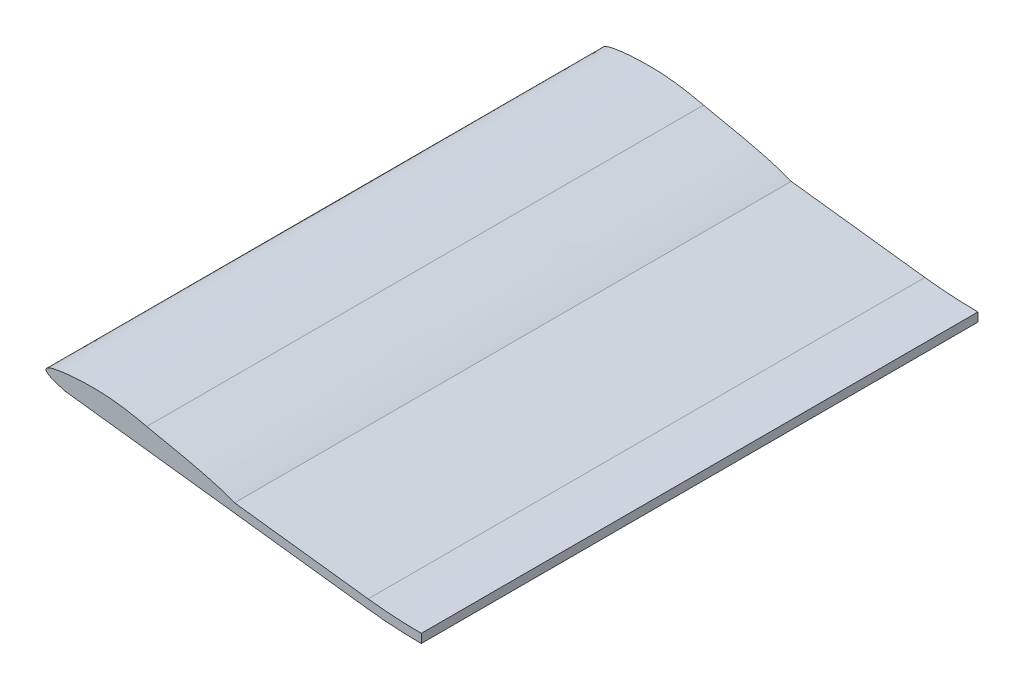
ISO-10303-21;
HEADER;
FILE_DESCRIPTION(('STEP AP214'),'2;1');
FILE_NAME('part.step','',(''),(''),'','','');
FILE_SCHEMA(('AUTOMOTIVE_DESIGN { 1 0 10303 214 1 1 1 1 }'));
ENDSEC;
DATA;
#1=APPLICATION_CONTEXT('core data for automotive mechanical design processes');
#2=APPLICATION_PROTOCOL_DEFINITION('international standard','automotive_design',2000,#1);
#3=PRODUCT_CONTEXT('',#1,'mechanical');
#4=PRODUCT('Part','Part','',(#3));
#5=PRODUCT_RELATED_PRODUCT_CATEGORY('part','',(#4));
#6=PRODUCT_DEFINITION_FORMATION('','',#4);
#7=PRODUCT_DEFINITION_CONTEXT('part definition',#1,'design');
#8=PRODUCT_DEFINITION('design','',#6,#7);
#9=PRODUCT_DEFINITION_SHAPE('','',#8);
#10=(LENGTH_UNIT() NAMED_UNIT(*) SI_UNIT(.MILLI.,.METRE.));
#11=(NAMED_UNIT(*) PLANE_ANGLE_UNIT() SI_UNIT($,.RADIAN.));
#12=(NAMED_UNIT(*) SI_UNIT($,.STERADIAN.) SOLID_ANGLE_UNIT());
#13=UNCERTAINTY_MEASURE_WITH_UNIT(LENGTH_MEASURE(1.E-05),#10,'distance_accuracy_value','');
#14=(GEOMETRIC_REPRESENTATION_CONTEXT(3) GLOBAL_UNCERTAINTY_ASSIGNED_CONTEXT((#13)) GLOBAL_UNIT_ASSIGNED_CONTEXT((#10,
#11,#12)) REPRESENTATION_CONTEXT('',''));
#15=CARTESIAN_POINT('',(0.,0.,0.));
#16=DIRECTION('',(0.,0.,1.));
#17=DIRECTION('',(1.,0.,0.));
#18=AXIS2_PLACEMENT_3D('',#15,#16,#17);
#19=CARTESIAN_POINT('',(-1376.89946624241,7.97944159795149,300.));
#20=CARTESIAN_POINT('',(-1400.62692267339,14.4748176161241,300.));
#21=CARTESIAN_POINT('',(-1356.47241270451,20.4165278977863,300.));
#22=CARTESIAN_POINT('',(-1325.57377215526,12.1218735207099,300.));
#23=CARTESIAN_POINT('',(-1294.16714389737,6.70322635564015,300.));
#24=CARTESIAN_POINT('',(-1280.44105962162,1.1733876229176,300.));
#25=B_SPLINE_CURVE_WITH_KNOTS('',3,(#19,#20,#21,#22,#23,#24),.UNSPECIFIED.,.F.,.F.,(4,1,1,4),
(0.,0.297228768096899,0.6124069189747,1.),.UNSPECIFIED.);
#26=DIRECTION('',(0.,0.,-1.));
#27=VECTOR('',#26,1.);
#28=SURFACE_OF_LINEAR_EXTRUSION('',#25,#27);
#29=DIRECTION('',(0.,0.,-1.));
#30=VECTOR('',#29,1.);
#31=CARTESIAN_POINT('',(-1387.26742948358,13.7744205498702,300.));
#32=LINE('',#31,#30);
#33=CARTESIAN_POINT('',(-1387.26742948358,13.7744205498701,616.));
#34=VERTEX_POINT('',#33);
#35=CARTESIAN_POINT('',(-1387.26742948358,13.7744205498702,300.));
#36=VERTEX_POINT('',#35);
#37=EDGE_CURVE('E13',#34,#36,#32,.T.);
#38=ORIENTED_EDGE('',*,*,#37,.T.);
#39=CARTESIAN_POINT('',(-1376.89946624241,7.97944159795149,300.));
#40=CARTESIAN_POINT('',(-1400.62692267339,14.4748176161241,300.));
#41=CARTESIAN_POINT('',(-1356.47241270451,20.4165278977863,300.));
#42=CARTESIAN_POINT('',(-1325.57377215526,12.1218735207099,300.));
#43=CARTESIAN_POINT('',(-1294.16714389737,6.70322635564015,300.));
#44=CARTESIAN_POINT('',(-1280.44105962162,1.1733876229176,300.));
#45=B_SPLINE_CURVE_WITH_KNOTS('',3,(#39,#40,#41,#42,#43,#44),.UNSPECIFIED.,.F.,.F.,(4,1,1,4),
(0.,0.297228768096899,0.6124069189747,1.),.UNSPECIFIED.);
#46=CARTESIAN_POINT('',(-1376.89946624241,7.97944159795149,300.));
#47=VERTEX_POINT('',#46);
#48=EDGE_CURVE('E189',#47,#36,#45,.T.);
#49=ORIENTED_EDGE('',*,*,#48,.F.);
#50=DIRECTION('',(0.,0.,-1.));
#51=VECTOR('',#50,1.);
#52=CARTESIAN_POINT('',(-1376.89946624241,7.97944159795149,300.));
#53=LINE('',#52,#51);
#54=CARTESIAN_POINT('',(-1376.89946624241,7.97944159795149,616.));
#55=VERTEX_POINT('',#54);
#56=EDGE_CURVE('E180',#55,#47,#53,.T.);
#57=ORIENTED_EDGE('',*,*,#56,.F.);
#58=CARTESIAN_POINT('',(-1376.89946624241,7.97944159795149,616.));
#59=CARTESIAN_POINT('',(-1377.10559932181,8.03587358965808,616.));
#60=CARTESIAN_POINT('',(-1377.31156661358,8.09291446148049,616.));
#61=CARTESIAN_POINT('',(-1377.72572935339,8.20906121368225,616.));
#62=CARTESIAN_POINT('',(-1377.93392003424,8.26818408733904,616.));
#63=CARTESIAN_POINT('',(-1378.35202039858,8.38853903831141,616.));
#64=CARTESIAN_POINT('',(-1378.56192563219,8.44978659180561,616.));
#65=CARTESIAN_POINT('',(-1378.98293859683,8.57445775450962,616.));
#66=CARTESIAN_POINT('',(-1379.19404230275,8.63789496779612,616.));
#67=CARTESIAN_POINT('',(-1379.61692994093,8.76703358194975,616.));
#68=CARTESIAN_POINT('',(-1379.82871045148,8.83274620515776,616.));
#69=CARTESIAN_POINT('',(-1380.2524189195,8.96655496809938,616.));
#70=CARTESIAN_POINT('',(-1380.46434427497,9.03465934888446,616.));
#71=CARTESIAN_POINT('',(-1381.01661926945,9.21560731824085,616.));
#72=CARTESIAN_POINT('',(-1381.35634383868,9.33036880620694,616.));
#73=CARTESIAN_POINT('',(-1382.03278113928,9.56746067515487,616.));
#74=CARTESIAN_POINT('',(-1382.36949655483,9.68978333205807,616.));
#75=CARTESIAN_POINT('',(-1382.87104889133,9.88036922150825,616.));
#76=CARTESIAN_POINT('',(-1383.03729210857,9.94493493954435,616.));
#77=CARTESIAN_POINT('',(-1383.36865588585,10.076880636935,616.));
#78=CARTESIAN_POINT('',(-1383.53377647864,10.1442605338004,616.));
#79=CARTESIAN_POINT('',(-1383.86149752485,10.2818132154702,616.));
#80=CARTESIAN_POINT('',(-1384.02410752631,10.3519631846966,616.));
#81=CARTESIAN_POINT('',(-1384.34761813229,10.4960760338678,616.));
#82=CARTESIAN_POINT('',(-1384.50851888743,10.570038574431,616.));
#83=CARTESIAN_POINT('',(-1384.82686126228,10.7219573228579,616.));
#84=CARTESIAN_POINT('',(-1384.98432024166,10.7998769397391,616.));
#85=CARTESIAN_POINT('',(-1385.29634029246,10.9612864441184,616.));
#86=CARTESIAN_POINT('',(-1385.45090179693,11.0447754905801,616.));
#87=CARTESIAN_POINT('',(-1385.75570133815,11.2186366470378,616.));
#88=CARTESIAN_POINT('',(-1385.90594844763,11.3089925920781,616.));
#89=CARTESIAN_POINT('',(-1386.12677429788,11.4514583939343,616.));
#90=CARTESIAN_POINT('',(-1386.19960142951,11.5000845793451,616.));
#91=CARTESIAN_POINT('',(-1386.34335772149,11.6000579106691,616.));
#92=CARTESIAN_POINT('',(-1386.41428723876,11.6514045393844,616.));
#93=CARTESIAN_POINT('',(-1386.53555170717,11.7435233585069,616.));
#94=CARTESIAN_POINT('',(-1386.58643944335,11.7835669771438,616.));
#95=CARTESIAN_POINT('',(-1386.6866056491,11.8656933041869,616.));
#96=CARTESIAN_POINT('',(-1386.73588305617,11.9077773151229,616.));
#97=CARTESIAN_POINT('',(-1386.83244419358,11.9943143642011,616.));
#98=CARTESIAN_POINT('',(-1386.87972513602,12.0387705308769,616.));
#99=CARTESIAN_POINT('',(-1386.97059091361,12.1293005415215,616.));
#100=CARTESIAN_POINT('',(-1387.01423572422,12.1753137178867,616.));
#101=CARTESIAN_POINT('',(-1387.09821857093,12.2702207272159,616.));
#102=CARTESIAN_POINT('',(-1387.13855920956,12.3191122398517,616.));
#103=CARTESIAN_POINT('',(-1387.21485121182,12.4201126492647,616.));
#104=CARTESIAN_POINT('',(-1387.25081147707,12.4722146857279,616.));
#105=CARTESIAN_POINT('',(-1387.30106096528,12.5541229970213,616.));
#106=CARTESIAN_POINT('',(-1387.3174701123,12.582633549943,616.));
#107=CARTESIAN_POINT('',(-1387.34845005028,12.6406306504229,616.));
#108=CARTESIAN_POINT('',(-1387.36302150547,12.6701168404522,616.));
#109=CARTESIAN_POINT('',(-1387.39002206765,12.7300268742398,616.));
#110=CARTESIAN_POINT('',(-1387.40245333555,12.7604497352233,616.));
#111=CARTESIAN_POINT('',(-1387.42488132207,12.822217999786,616.));
#112=CARTESIAN_POINT('',(-1387.43487526226,12.8535644109792,616.));
#113=CARTESIAN_POINT('',(-1387.45813685873,12.9393939371932,616.));
#114=CARTESIAN_POINT('',(-1387.46875829233,12.9946338603826,616.));
#115=CARTESIAN_POINT('',(-1387.48046370835,13.1061062338817,616.));
#116=CARTESIAN_POINT('',(-1387.48156012353,13.1623372943333,616.));
#117=CARTESIAN_POINT('',(-1387.4757327961,13.2461719614413,616.));
#118=CARTESIAN_POINT('',(-1387.47253393127,13.2740756171652,616.));
#119=CARTESIAN_POINT('',(-1387.46370953273,13.329482149259,616.));
#120=CARTESIAN_POINT('',(-1387.4580852809,13.3569852294156,616.));
#121=CARTESIAN_POINT('',(-1387.43772393909,13.4386508538961,616.));
#122=CARTESIAN_POINT('',(-1387.4194985435,13.491966056697,616.));
#123=CARTESIAN_POINT('',(-1387.36788509003,13.6125051150773,616.));
#124=CARTESIAN_POINT('',(-1387.33146256725,13.6784027181051,616.));
#125=CARTESIAN_POINT('',(-1387.24878146527,13.8037156121293,616.));
#126=CARTESIAN_POINT('',(-1387.20249721534,13.8631133607172,616.));
#127=CARTESIAN_POINT('',(-1387.10784528255,13.9706784381311,616.));
#128=CARTESIAN_POINT('',(-1387.060067443,14.0193763832744,616.));
#129=CARTESIAN_POINT('',(-1386.96052103794,14.1125484682299,616.));
#130=CARTESIAN_POINT('',(-1386.9087488983,14.157018743786,616.));
#131=CARTESIAN_POINT('',(-1386.80219575232,14.2424261963095,616.));
#132=CARTESIAN_POINT('',(-1386.74740790063,14.2833547430979,616.));
#133=CARTESIAN_POINT('',(-1386.6356868198,14.3620951338664,616.));
#134=CARTESIAN_POINT('',(-1386.57875447175,14.3999082379457,616.));
#135=CARTESIAN_POINT('',(-1386.45642974705,14.4771870113068,616.));
#136=CARTESIAN_POINT('',(-1386.39083032273,14.5163233554486,616.));
#137=CARTESIAN_POINT('',(-1386.25803751536,14.5918031818058,616.));
#138=CARTESIAN_POINT('',(-1386.19084378736,14.6281460522951,616.));
#139=CARTESIAN_POINT('',(-1385.98718091869,14.7337244256374,616.));
#140=CARTESIAN_POINT('',(-1385.84885226192,14.799373967021,616.));
#141=CARTESIAN_POINT('',(-1385.5689168085,14.9235005623852,616.));
#142=CARTESIAN_POINT('',(-1385.42730693435,14.9819705296954,616.));
#143=CARTESIAN_POINT('',(-1385.1410493615,15.0935327548931,616.));
#144=CARTESIAN_POINT('',(-1384.99638878677,15.1465917663851,616.));
#145=CARTESIAN_POINT('',(-1384.70564654503,15.2479761349737,616.));
#146=CARTESIAN_POINT('',(-1384.55956701678,15.296307675713,616.));
#147=CARTESIAN_POINT('',(-1384.26626332117,15.3890821597214,616.));
#148=CARTESIAN_POINT('',(-1384.11903974016,15.4335269681485,616.));
#149=CARTESIAN_POINT('',(-1383.70995727964,15.5521257191271,616.));
#150=CARTESIAN_POINT('',(-1383.44709363696,15.6228128159153,616.));
#151=CARTESIAN_POINT('',(-1382.91936385474,15.7563266149848,616.));
#152=CARTESIAN_POINT('',(-1382.65449740385,15.8191520673311,616.));
#153=CARTESIAN_POINT('',(-1382.1229650218,15.9385384175811,616.));
#154=CARTESIAN_POINT('',(-1381.85629705414,15.9950901984809,616.));
#155=CARTESIAN_POINT('',(-1381.32189468029,16.1029161952263,616.));
#156=CARTESIAN_POINT('',(-1381.05416024018,16.1541902417516,616.));
#157=CARTESIAN_POINT('',(-1380.51749162167,16.2523274558758,616.));
#158=CARTESIAN_POINT('',(-1380.24855627452,16.2991842044673,616.));
#159=CARTESIAN_POINT('',(-1379.71003661255,16.3890063941388,616.));
#160=CARTESIAN_POINT('',(-1379.44045228932,16.4319717844294,616.));
#161=CARTESIAN_POINT('',(-1378.63087313839,16.5557690528167,616.));
#162=CARTESIAN_POINT('',(-1378.09009502969,16.6314943563582,616.));
#163=CARTESIAN_POINT('',(-1377.00807863036,16.7719034373336,616.));
#164=CARTESIAN_POINT('',(-1376.46684273714,16.8366060102775,616.));
#165=CARTESIAN_POINT('',(-1375.38398166942,16.9567972106447,616.));
#166=CARTESIAN_POINT('',(-1374.84235764972,17.0122963004009,616.));
#167=CARTESIAN_POINT('',(-1373.75855999863,17.1153570434646,616.));
#168=CARTESIAN_POINT('',(-1373.21638663996,17.1629215860796,616.));
#169=CARTESIAN_POINT('',(-1372.13129037316,17.250989964278,616.));
#170=CARTESIAN_POINT('',(-1371.58836727717,17.2914914725964,616.));
#171=CARTESIAN_POINT('',(-1370.45788606029,17.3690277519527,616.));
#172=CARTESIAN_POINT('',(-1369.87029030527,17.4055123670845,616.));
#173=CARTESIAN_POINT('',(-1368.69469438734,17.4713562862471,616.));
#174=CARTESIAN_POINT('',(-1368.10669421964,17.5007155043084,616.));
#175=CARTESIAN_POINT('',(-1366.92975208821,17.5525731669881,616.));
#176=CARTESIAN_POINT('',(-1366.34080979512,17.5750641276652,616.));
#177=CARTESIAN_POINT('',(-1365.1627048489,17.6131659820636,616.));
#178=CARTESIAN_POINT('',(-1364.57354219659,17.6287769012033,616.));
#179=CARTESIAN_POINT('',(-1363.39488815817,17.6528790911732,616.));
#180=CARTESIAN_POINT('',(-1362.80539672663,17.6613681822236,616.));
#181=CARTESIAN_POINT('',(-1361.62635710593,17.6708262212208,616.));
#182=CARTESIAN_POINT('',(-1361.03680891679,17.6717951706705,616.));
#183=CARTESIAN_POINT('',(-1359.26871468234,17.6628630854307,616.));
#184=CARTESIAN_POINT('',(-1358.0901972813,17.641134449485,616.));
#185=CARTESIAN_POINT('',(-1355.7354211015,17.5633291457871,616.));
#186=CARTESIAN_POINT('',(-1354.55916124058,17.5072853824696,616.));
#187=CARTESIAN_POINT('',(-1352.21047250895,17.3587173298899,616.));
#188=CARTESIAN_POINT('',(-1351.03804062399,17.2662416437172,616.));
#189=CARTESIAN_POINT('',(-1349.27898376581,17.099130438101,616.));
#190=CARTESIAN_POINT('',(-1348.69099798329,17.0384941946363,616.));
#191=CARTESIAN_POINT('',(-1347.51607457213,16.9078151103728,616.));
#192=CARTESIAN_POINT('',(-1346.92913693121,16.837772380465,616.));
#193=CARTESIAN_POINT('',(-1345.75650663328,16.6884650126062,616.));
#194=CARTESIAN_POINT('',(-1345.17081384181,16.6092014282877,616.));
#195=CARTESIAN_POINT('',(-1344.00070096476,16.4417904987352,616.));
#196=CARTESIAN_POINT('',(-1343.41628087928,16.3536431528599,616.));
#197=CARTESIAN_POINT('',(-1342.24846358651,16.168933334444,616.));
#198=CARTESIAN_POINT('',(-1341.66506706899,16.0723665106585,616.));
#199=CARTESIAN_POINT('',(-1340.49960044743,15.871553434744,616.));
#200=CARTESIAN_POINT('',(-1339.91753034389,15.7673071797265,616.));
#201=CARTESIAN_POINT('',(-1338.75414898549,15.5519101028218,616.));
#202=CARTESIAN_POINT('',(-1338.17283883169,15.4407533516865,616.));
#203=CARTESIAN_POINT('',(-1337.01136023702,15.2126426425003,616.));
#204=CARTESIAN_POINT('',(-1336.43119179728,15.0956886787599,616.));
#205=CARTESIAN_POINT('',(-1335.27135903696,14.8570416344822,616.));
#206=CARTESIAN_POINT('',(-1334.69169546967,14.7353449057238,616.));
#207=CARTESIAN_POINT('',(-1333.53309740608,14.4885414234781,616.));
#208=CARTESIAN_POINT('',(-1332.9541629097,14.3634346703651,616.));
#209=CARTESIAN_POINT('',(-1331.7965852555,14.1110606849079,616.));
#210=CARTESIAN_POINT('',(-1331.21794223664,13.9837928174276,616.));
#211=CARTESIAN_POINT('',(-1330.06084064353,13.7284216128202,616.));
#212=CARTESIAN_POINT('',(-1329.48238206944,13.6003182749474,616.));
#213=CARTESIAN_POINT('',(-1328.56177330007,13.3967834551106,616.));
#214=CARTESIAN_POINT('',(-1328.21965242175,13.3212195861388,616.));
#215=CARTESIAN_POINT('',(-1327.53532582951,13.1704770679976,616.));
#216=CARTESIAN_POINT('',(-1327.19312011561,13.0952984187186,616.));
#217=CARTESIAN_POINT('',(-1326.50857390825,12.9455618628941,616.));
#218=CARTESIAN_POINT('',(-1326.16623341523,12.8710039543062,616.));
#219=CARTESIAN_POINT('',(-1325.48137285666,12.7227173725383,616.));
#220=CARTESIAN_POINT('',(-1325.13885279112,12.6489886993577,616.));
#221=CARTESIAN_POINT('',(-1324.45384036181,12.5022659686637,616.));
#222=CARTESIAN_POINT('',(-1324.11134807498,12.429271551655,616.));
#223=CARTESIAN_POINT('',(-1323.42623990157,12.28386490226,616.));
#224=CARTESIAN_POINT('',(-1323.08362401497,12.2114526700279,616.));
#225=CARTESIAN_POINT('',(-1322.05562542676,11.9949210280287,616.));
#226=CARTESIAN_POINT('',(-1321.3700941808,11.8515071819623,616.));
#227=CARTESIAN_POINT('',(-1319.99914985061,11.56581206236,616.));
#228=CARTESIAN_POINT('',(-1319.31373687545,11.4235302640729,616.));
#229=CARTESIAN_POINT('',(-1317.94284733035,11.1392786548157,616.));
#230=CARTESIAN_POINT('',(-1317.25737076051,10.9973088434122,616.));
#231=CARTESIAN_POINT('',(-1315.88684576334,10.7130530691468,616.));
#232=CARTESIAN_POINT('',(-1315.20179729529,10.5707673032964,616.));
#233=CARTESIAN_POINT('',(-1313.83191912745,10.2851460845697,616.));
#234=CARTESIAN_POINT('',(-1313.14708942773,10.141810631364,616.));
#235=CARTESIAN_POINT('',(-1311.09383052273,9.70941761459142,616.));
#236=CARTESIAN_POINT('',(-1309.72593073338,9.41782942400285,616.));
#237=CARTESIAN_POINT('',(-1306.99328728128,8.82309915737215,616.));
#238=CARTESIAN_POINT('',(-1305.62854245887,8.51996244097756,616.));
#239=CARTESIAN_POINT('',(-1302.9214656525,7.9013198616558,616.));
#240=CARTESIAN_POINT('',(-1301.57908234811,7.58603977988466,616.));
#241=CARTESIAN_POINT('',(-1298.899515461,6.93431715587263,616.));
#242=CARTESIAN_POINT('',(-1297.56233157365,6.5978758739784,616.));
#243=CARTESIAN_POINT('',(-1294.89451333153,5.89822066925104,616.));
#244=CARTESIAN_POINT('',(-1293.5638811182,5.53499854199399,616.));
#245=CARTESIAN_POINT('',(-1290.91070850373,4.77529313800796,616.));
#246=CARTESIAN_POINT('',(-1289.5881767995,4.37877917887172,616.));
#247=CARTESIAN_POINT('',(-1287.61264016945,3.75339801911065,616.));
#248=CARTESIAN_POINT('',(-1286.95485104388,3.53960673793806,616.));
#249=CARTESIAN_POINT('',(-1285.64301898217,3.10085416624144,616.));
#250=CARTESIAN_POINT('',(-1284.98897594333,2.87589318359945,616.));
#251=CARTESIAN_POINT('',(-1283.68288751582,2.41282813502006,616.));
#252=CARTESIAN_POINT('',(-1283.03085786298,2.17467955296651,616.));
#253=CARTESIAN_POINT('',(-1281.7319099413,1.68465326262107,616.));
#254=CARTESIAN_POINT('',(-1281.08499218569,1.43277419536898,616.));
#255=CARTESIAN_POINT('',(-1280.44105962162,1.1733876229176,616.));
#256=B_SPLINE_CURVE_WITH_KNOTS('',3,(#58,#59,#60,#61,#62,#63,#64,#65,#66,#67,#68,#69,#70,#71,
#72,#73,#74,#75,#76,#77,#78,#79,#80,#81,#82,#83,#84,#85,#86,#87,#88,#89,#90,#91,#92,#93,#94,#95,
#96,#97,#98,#99,#100,#101,#102,#103,#104,#105,#106,#107,#108,#109,#110,#111,#112,#113,#114,#115,
#116,#117,#118,#119,#120,#121,#122,#123,#124,#125,#126,#127,#128,#129,#130,#131,#132,#133,#134,
#135,#136,#137,#138,#139,#140,#141,#142,#143,#144,#145,#146,#147,#148,#149,#150,#151,#152,#153,
#154,#155,#156,#157,#158,#159,#160,#161,#162,#163,#164,#165,#166,#167,#168,#169,#170,#171,#172,
#173,#174,#175,#176,#177,#178,#179,#180,#181,#182,#183,#184,#185,#186,#187,#188,#189,#190,#191,
#192,#193,#194,#195,#196,#197,#198,#199,#200,#201,#202,#203,#204,#205,#206,#207,#208,#209,#210,
#211,#212,#213,#214,#215,#216,#217,#218,#219,#220,#221,#222,#223,#224,#225,#226,#227,#228,#229,
#230,#231,#232,#233,#234,#235,#236,#237,#238,#239,#240,#241,#242,#243,#244,#245,#246,#247,#248,
#249,#250,#251,#252,#253,#254,#255),.UNSPECIFIED.,.F.,.F.,(4,2,2,2,2,2,2,2,2,2,2,2,2,2,2,2,2,2,
2,2,2,2,2,2,2,2,2,2,2,2,2,2,2,2,2,2,2,2,2,2,2,2,2,2,2,2,2,2,2,2,2,2,2,2,2,2,2,2,2,2,2,2,2,2,2,2,
2,2,2,2,2,2,2,2,2,2,2,2,2,2,2,2,2,2,2,2,2,2,2,2,2,2,2,2,2,2,2,2,4),(0.,0.641154592746128,
1.29041849442369,1.94638712900553,2.60766715794277,3.27288016488498,3.94066790590432,
5.01635177545694,6.09095438561435,6.6259573071867,7.16094455776156,7.69219208949669,
8.22339241286647,8.75035257158444,9.27723333370757,9.80291008332669,10.065569713323,
10.3281795856465,10.5223987803484,10.7167436350056,10.9113514623093,11.1014863007959,
11.2914699096956,11.481060761776,11.5796933107784,11.678290107021,11.7767867604165,
11.8753951751834,12.0434034731278,12.2111924411461,12.2953557880387,12.3794747070118,
12.547723599081,12.7723540117534,12.9975764562909,13.2019424339759,13.406493449483,
13.6115296306195,13.8164824696922,14.0455581495666,14.2746838512757,14.7337143201391,
15.1931942982915,15.6553459931179,16.1168848637935,16.578201022543,17.3946299902428,
18.2111885987626,19.0289187150571,19.8466750575939,20.6656019759419,21.4845395812372,
23.1225454928307,24.7577297632126,26.3910422541026,28.0237586816926,29.6570120759142,
31.423147691864,33.1893046155154,34.957379206863,36.7254472660172,38.4940562810084,
40.2626649425498,43.798317307298,47.3305846680499,50.8581555737525,52.6314045851498,
54.4046326939167,56.177658381195,57.9506841964803,59.7246318177563,61.4985801062894,
63.2740720409073,65.0495657180466,66.8264531906288,68.6033404681826,70.3807593226059,
72.1581797639168,73.2092787718865,74.2603774807273,75.3114727297279,76.3625679779863,
77.413120758471,78.4636738173498,80.5647872484503,82.6648621812686,84.7649341947539,
86.8639404244796,88.9629473131615,93.15881486224,97.3527582891799,101.489360744496,
105.625717059459,109.763345872221,113.904830767026,115.979727780587,118.054567633333,
120.136897892016,122.219434622649),.UNSPECIFIED.);
#257=EDGE_CURVE('E144',#55,#34,#256,.T.);
#258=ORIENTED_EDGE('',*,*,#257,.T.);
#259=EDGE_LOOP('',(#38,#49,#57,#258));
#260=FACE_BOUND('',#259,.T.);
#261=ADVANCED_FACE('F49',(#260),#28,.T.);
#262=DIRECTION('',(0.,0.,-1.));
#263=VECTOR('',#262,1.);
#264=CARTESIAN_POINT('',(-1330.26950820948,13.7744205498702,300.));
#265=LINE('',#264,#263);
#266=CARTESIAN_POINT('',(-1330.26950820948,13.7744205498703,300.));
#267=VERTEX_POINT('',#266);
#268=CARTESIAN_POINT('',(-1330.26950820948,13.7744205498702,616.));
#269=VERTEX_POINT('',#268);
#270=EDGE_CURVE('E53',#267,#269,#265,.F.);
#271=ORIENTED_EDGE('',*,*,#270,.T.);
#272=CARTESIAN_POINT('',(-1280.44105962162,1.1733876229176,616.));
#273=VERTEX_POINT('',#272);
#274=EDGE_CURVE('E141',#269,#273,#256,.T.);
#275=ORIENTED_EDGE('',*,*,#274,.T.);
#276=DIRECTION('',(0.,0.,-1.));
#277=VECTOR('',#276,1.);
#278=CARTESIAN_POINT('',(-1280.44105962162,1.1733876229176,300.));
#279=LINE('',#278,#277);
#280=CARTESIAN_POINT('',(-1280.44105962162,1.17338762291759,300.));
#281=VERTEX_POINT('',#280);
#282=EDGE_CURVE('E169',#273,#281,#279,.T.);
#283=ORIENTED_EDGE('',*,*,#282,.T.);
#284=EDGE_CURVE('E195',#267,#281,#45,.T.);
#285=ORIENTED_EDGE('',*,*,#284,.F.);
#286=EDGE_LOOP('',(#271,#275,#283,#285));
#287=FACE_BOUND('',#286,.T.);
#288=ADVANCED_FACE('F162',(#287),#28,.T.);
#289=CARTESIAN_POINT('',(-1189.74693314729,-15.,300.));
#290=DIRECTION('',(0.121869343405148,0.992546151641322,0.));
#291=DIRECTION('',(-0.992546151641322,0.121869343405148,0.));
#292=AXIS2_PLACEMENT_3D('',#289,#290,#291);
#293=PLANE('',#292);
#294=DIRECTION('',(0.,0.,1.));
#295=VECTOR('',#294,1.);
#296=CARTESIAN_POINT('',(-1204.92361396095,-13.1365379103305,300.));
#297=LINE('',#296,#295);
#298=CARTESIAN_POINT('',(-1204.92361396095,-13.1365379103304,616.));
#299=VERTEX_POINT('',#298);
#300=CARTESIAN_POINT('',(-1204.92361396095,-13.1365379103305,300.));
#301=VERTEX_POINT('',#300);
#302=EDGE_CURVE('E215',#299,#301,#297,.F.);
#303=ORIENTED_EDGE('',*,*,#302,.F.);
#304=DIRECTION('',(-0.992546151641322,0.121869343405147,0.));
#305=VECTOR('',#304,1.);
#306=CARTESIAN_POINT('',(-1204.92361396095,-13.1365379103303,616.));
#307=LINE('',#306,#305);
#308=EDGE_CURVE('E139',#299,#55,#307,.T.);
#309=ORIENTED_EDGE('',*,*,#308,.T.);
#310=ORIENTED_EDGE('',*,*,#56,.T.);
#311=DIRECTION('',(-0.992546151641322,0.121869343405148,0.));
#312=VECTOR('',#311,1.);
#313=CARTESIAN_POINT('',(-1189.74693314729,-15.,300.));
#314=LINE('',#313,#312);
#315=EDGE_CURVE('E187',#301,#47,#314,.T.);
#316=ORIENTED_EDGE('',*,*,#315,.F.);
#317=EDGE_LOOP('',(#303,#309,#310,#316));
#318=FACE_BOUND('',#317,.T.);
#319=ADVANCED_FACE('F161',(#318),#293,.F.);
#320=EDGE_CURVE('E65',#34,#269,#256,.T.);
#321=ORIENTED_EDGE('',*,*,#320,.T.);
#322=ORIENTED_EDGE('',*,*,#270,.F.);
#323=EDGE_CURVE('E194',#36,#267,#45,.T.);
#324=ORIENTED_EDGE('',*,*,#323,.F.);
#325=ORIENTED_EDGE('',*,*,#37,.F.);
#326=EDGE_LOOP('',(#321,#322,#324,#325));
#327=FACE_BOUND('',#326,.T.);
#328=ADVANCED_FACE('F154',(#327),#28,.T.);
#329=CARTESIAN_POINT('',(-1280.44105962162,1.1733876229176,300.));
#330=DIRECTION('',(-0.121869343405141,-0.992546151641323,0.));
#331=DIRECTION('',(0.992546151641323,-0.121869343405141,0.));
#332=AXIS2_PLACEMENT_3D('',#329,#330,#331);
#333=PLANE('',#332);
#334=ORIENTED_EDGE('',*,*,#282,.F.);
#335=DIRECTION('',(0.992546151641323,-0.121869343405141,0.));
#336=VECTOR('',#335,1.);
#337=CARTESIAN_POINT('',(-1280.44105962162,1.1733876229176,616.));
#338=LINE('',#337,#336);
#339=CARTESIAN_POINT('',(-1204.6178008602,-8.1365379103305,616.));
#340=VERTEX_POINT('',#339);
#341=EDGE_CURVE('E142',#273,#340,#338,.T.);
#342=ORIENTED_EDGE('',*,*,#341,.T.);
#343=DIRECTION('',(0.,0.,-1.));
#344=VECTOR('',#343,1.);
#345=CARTESIAN_POINT('',(-1204.6178008602,-8.13653791033053,300.));
#346=LINE('',#345,#344);
#347=CARTESIAN_POINT('',(-1204.6178008602,-8.13653791033056,300.));
#348=VERTEX_POINT('',#347);
#349=EDGE_CURVE('E134',#348,#340,#346,.F.);
#350=ORIENTED_EDGE('',*,*,#349,.F.);
#351=DIRECTION('',(0.992546151641323,-0.121869343405141,0.));
#352=VECTOR('',#351,1.);
#353=CARTESIAN_POINT('',(-1280.44105962162,1.1733876229176,300.));
#354=LINE('',#353,#352);
#355=EDGE_CURVE('E131',#281,#348,#354,.T.);
#356=ORIENTED_EDGE('',*,*,#355,.F.);
#357=EDGE_LOOP('',(#334,#342,#350,#356));
#358=FACE_BOUND('',#357,.T.);
#359=ADVANCED_FACE('F160',(#358),#333,.F.);
#360=CARTESIAN_POINT('',(-1174.45627810966,235.,-305.));
#361=DIRECTION('',(0.,0.,1.));
#362=DIRECTION('',(-1.,0.,0.));
#363=AXIS2_PLACEMENT_3D('',#360,#361,#362);
#364=CYLINDRICAL_SURFACE('',#363,250.);
#365=CARTESIAN_POINT('',(-1174.45627810966,235.,300.));
#366=DIRECTION('',(0.,0.,-1.));
#367=DIRECTION('',(-1.,0.,0.));
#368=AXIS2_PLACEMENT_3D('',#365,#366,#367);
#369=CIRCLE('',#368,250.);
#370=CARTESIAN_POINT('',(-1174.45627810966,-15.,300.));
#371=VERTEX_POINT('',#370);
#372=EDGE_CURVE('E184',#301,#371,#369,.F.);
#373=ORIENTED_EDGE('',*,*,#372,.T.);
#374=DIRECTION('',(0.,0.,1.));
#375=VECTOR('',#374,1.);
#376=CARTESIAN_POINT('',(-1174.45627810966,-15.,-305.));
#377=LINE('',#376,#375);
#378=CARTESIAN_POINT('',(-1174.45627810966,-14.9999999999999,616.));
#379=VERTEX_POINT('',#378);
#380=EDGE_CURVE('E178',#371,#379,#377,.T.);
#381=ORIENTED_EDGE('',*,*,#380,.T.);
#382=CARTESIAN_POINT('',(-1174.45627810966,235.,616.));
#383=DIRECTION('',(0.,0.,-1.));
#384=DIRECTION('',(-1.,0.,0.));
#385=AXIS2_PLACEMENT_3D('',#382,#383,#384);
#386=CIRCLE('',#385,250.);
#387=EDGE_CURVE('E120',#379,#299,#386,.T.);
#388=ORIENTED_EDGE('',*,*,#387,.T.);
#389=ORIENTED_EDGE('',*,*,#302,.T.);
#390=EDGE_LOOP('',(#373,#381,#388,#389));
#391=FACE_BOUND('',#390,.T.);
#392=ADVANCED_FACE('F280',(#391),#364,.T.);
#393=CARTESIAN_POINT('',(-1174.15046500891,240.,300.));
#394=DIRECTION('',(0.,0.,1.));
#395=DIRECTION('',(-1.,0.,0.));
#396=AXIS2_PLACEMENT_3D('',#393,#394,#395);
#397=CYLINDRICAL_SURFACE('',#396,250.);
#398=CARTESIAN_POINT('',(-1174.15046500891,240.,300.));
#399=DIRECTION('',(0.,0.,-1.));
#400=DIRECTION('',(-1.,0.,0.));
#401=AXIS2_PLACEMENT_3D('',#398,#399,#400);
#402=CIRCLE('',#401,250.);
#403=CARTESIAN_POINT('',(-1174.45627810966,-9.99981295662467,300.));
#404=VERTEX_POINT('',#403);
#405=EDGE_CURVE('E211',#348,#404,#402,.F.);
#406=ORIENTED_EDGE('',*,*,#405,.F.);
#407=ORIENTED_EDGE('',*,*,#349,.T.);
#408=CARTESIAN_POINT('',(-1174.15046500891,240.,616.));
#409=DIRECTION('',(0.,0.,1.));
#410=DIRECTION('',(-1.,0.,0.));
#411=AXIS2_PLACEMENT_3D('',#408,#409,#410);
#412=CIRCLE('',#411,250.);
#413=CARTESIAN_POINT('',(-1174.45627810966,-9.99981295662464,616.));
#414=VERTEX_POINT('',#413);
#415=EDGE_CURVE('E117',#340,#414,#412,.T.);
#416=ORIENTED_EDGE('',*,*,#415,.T.);
#417=DIRECTION('',(0.,0.,1.));
#418=VECTOR('',#417,1.);
#419=CARTESIAN_POINT('',(-1174.45627810966,-9.99981295662464,300.));
#420=LINE('',#419,#418);
#421=EDGE_CURVE('E126',#404,#414,#420,.T.);
#422=ORIENTED_EDGE('',*,*,#421,.F.);
#423=EDGE_LOOP('',(#406,#407,#416,#422));
#424=FACE_BOUND('',#423,.T.);
#425=ADVANCED_FACE('F51',(#424),#397,.F.);
#426=CARTESIAN_POINT('',(-1174.15046500891,-400.,300.));
#427=DIRECTION('',(0.,0.,1.));
#428=DIRECTION('',(-1.,0.,0.));
#429=AXIS2_PLACEMENT_3D('',#426,#427,#428);
#430=PLANE('',#429);
#431=ORIENTED_EDGE('',*,*,#372,.F.);
#432=ORIENTED_EDGE('',*,*,#315,.T.);
#433=ORIENTED_EDGE('',*,*,#48,.T.);
#434=ORIENTED_EDGE('',*,*,#323,.T.);
#435=ORIENTED_EDGE('',*,*,#284,.T.);
#436=ORIENTED_EDGE('',*,*,#355,.T.);
#437=ORIENTED_EDGE('',*,*,#405,.T.);
#438=DIRECTION('',(0.,1.,0.));
#439=VECTOR('',#438,1.);
#440=CARTESIAN_POINT('',(-1174.45627810966,-16.8133173139919,300.));
#441=LINE('',#440,#439);
#442=EDGE_CURVE('E128',#371,#404,#441,.T.);
#443=ORIENTED_EDGE('',*,*,#442,.F.);
#444=EDGE_LOOP('',(#431,#432,#433,#434,#435,#436,#437,#443));
#445=FACE_BOUND('',#444,.T.);
#446=ADVANCED_FACE('F204',(#445),#430,.F.);
#447=CARTESIAN_POINT('',(-1174.45627810966,-15.,300.));
#448=DIRECTION('',(-1.,0.,0.));
#449=DIRECTION('',(0.,0.,-1.));
#450=AXIS2_PLACEMENT_3D('',#447,#448,#449);
#451=PLANE('',#450);
#452=ORIENTED_EDGE('',*,*,#380,.F.);
#453=ORIENTED_EDGE('',*,*,#442,.T.);
#454=ORIENTED_EDGE('',*,*,#421,.T.);
#455=DIRECTION('',(0.,-1.,0.));
#456=VECTOR('',#455,1.);
#457=CARTESIAN_POINT('',(-1174.45627810966,-9.99981295662464,616.));
#458=LINE('',#457,#456);
#459=EDGE_CURVE('E113',#414,#379,#458,.T.);
#460=ORIENTED_EDGE('',*,*,#459,.T.);
#461=EDGE_LOOP('',(#452,#453,#454,#460));
#462=FACE_BOUND('',#461,.T.);
#463=ADVANCED_FACE('F127',(#462),#451,.F.);
#464=CARTESIAN_POINT('',(-1174.15046500891,240.,616.));
#465=DIRECTION('',(0.,0.,1.));
#466=DIRECTION('',(-1.,0.,0.));
#467=AXIS2_PLACEMENT_3D('',#464,#465,#466);
#468=PLANE('',#467);
#469=ORIENTED_EDGE('',*,*,#415,.F.);
#470=ORIENTED_EDGE('',*,*,#341,.F.);
#471=ORIENTED_EDGE('',*,*,#274,.F.);
#472=ORIENTED_EDGE('',*,*,#320,.F.);
#473=ORIENTED_EDGE('',*,*,#257,.F.);
#474=ORIENTED_EDGE('',*,*,#308,.F.);
#475=ORIENTED_EDGE('',*,*,#387,.F.);
#476=ORIENTED_EDGE('',*,*,#459,.F.);
#477=EDGE_LOOP('',(#469,#470,#471,#472,#473,#474,#475,#476));
#478=FACE_BOUND('',#477,.T.);
#479=ADVANCED_FACE('F115',(#478),#468,.T.);
#480=CLOSED_SHELL('',(#261,#288,#319,#328,#359,#392,#425,#446,#463,#479));
#481=MANIFOLD_SOLID_BREP('B2',#480);
#482=ADVANCED_BREP_SHAPE_REPRESENTATION('',(#18,#481),#14);
#483=SHAPE_DEFINITION_REPRESENTATION(#9,#482);
ENDSEC;
END-ISO-10303-21;
